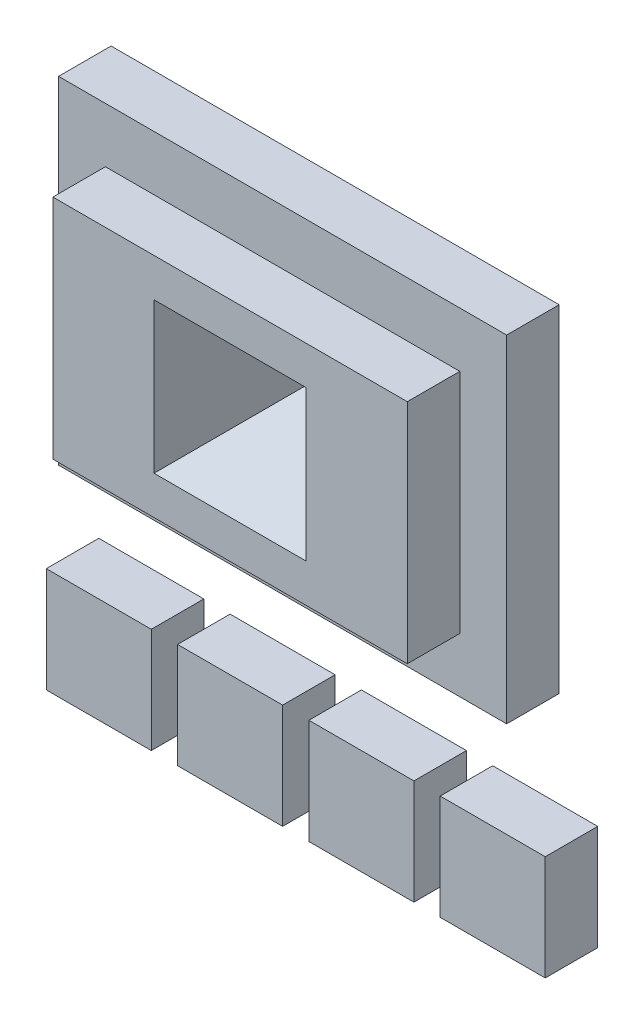
ISO-10303-21;
HEADER;
FILE_DESCRIPTION(('STEP AP214'),'2;1');
FILE_NAME('part.step','',(''),(''),'','','');
FILE_SCHEMA(('AUTOMOTIVE_DESIGN { 1 0 10303 214 1 1 1 1 }'));
ENDSEC;
DATA;
#1=APPLICATION_CONTEXT('core data for automotive mechanical design processes');
#2=APPLICATION_PROTOCOL_DEFINITION('international standard','automotive_design',2000,#1);
#3=PRODUCT_CONTEXT('',#1,'mechanical');
#4=PRODUCT('Part','Part','',(#3));
#5=PRODUCT_RELATED_PRODUCT_CATEGORY('part','',(#4));
#6=PRODUCT_DEFINITION_FORMATION('','',#4);
#7=PRODUCT_DEFINITION_CONTEXT('part definition',#1,'design');
#8=PRODUCT_DEFINITION('design','',#6,#7);
#9=PRODUCT_DEFINITION_SHAPE('','',#8);
#10=(LENGTH_UNIT() NAMED_UNIT(*) SI_UNIT(.MILLI.,.METRE.));
#11=(NAMED_UNIT(*) PLANE_ANGLE_UNIT() SI_UNIT($,.RADIAN.));
#12=(NAMED_UNIT(*) SI_UNIT($,.STERADIAN.) SOLID_ANGLE_UNIT());
#13=UNCERTAINTY_MEASURE_WITH_UNIT(LENGTH_MEASURE(1.E-05),#10,'distance_accuracy_value','');
#14=(GEOMETRIC_REPRESENTATION_CONTEXT(3) GLOBAL_UNCERTAINTY_ASSIGNED_CONTEXT((#13)) GLOBAL_UNIT_ASSIGNED_CONTEXT((#10,
#11,#12)) REPRESENTATION_CONTEXT('',''));
#15=CARTESIAN_POINT('',(0.,0.,0.));
#16=DIRECTION('',(0.,0.,1.));
#17=DIRECTION('',(1.,0.,0.));
#18=AXIS2_PLACEMENT_3D('',#15,#16,#17);
#19=CARTESIAN_POINT('',(77.6562191361146,92.3452044858512,10.));
#20=DIRECTION('',(-1.,0.,0.));
#21=DIRECTION('',(0.,0.,1.));
#22=AXIS2_PLACEMENT_3D('',#19,#20,#21);
#23=PLANE('',#22);
#24=DIRECTION('',(0.,1.,0.));
#25=VECTOR('',#24,1.);
#26=CARTESIAN_POINT('',(77.6562191361146,92.3452044858512,0.));
#27=LINE('',#26,#25);
#28=CARTESIAN_POINT('',(77.6562191361146,28.2315557489202,0.));
#29=VERTEX_POINT('',#28);
#30=CARTESIAN_POINT('',(77.6562191361146,92.3452044858512,0.));
#31=VERTEX_POINT('',#30);
#32=EDGE_CURVE('E231',#29,#31,#27,.T.);
#33=ORIENTED_EDGE('',*,*,#32,.T.);
#34=DIRECTION('',(0.,0.,-1.));
#35=VECTOR('',#34,1.);
#36=CARTESIAN_POINT('',(77.6562191361146,92.3452044858512,10.));
#37=LINE('',#36,#35);
#38=CARTESIAN_POINT('',(77.6562191361146,92.3452044858512,10.));
#39=VERTEX_POINT('',#38);
#40=EDGE_CURVE('E12',#39,#31,#37,.T.);
#41=ORIENTED_EDGE('',*,*,#40,.F.);
#42=DIRECTION('',(0.,1.,0.));
#43=VECTOR('',#42,1.);
#44=CARTESIAN_POINT('',(77.6562191361146,92.3452044858512,10.));
#45=LINE('',#44,#43);
#46=CARTESIAN_POINT('',(77.6562191361146,28.2315557489202,10.));
#47=VERTEX_POINT('',#46);
#48=EDGE_CURVE('E232',#47,#39,#45,.T.);
#49=ORIENTED_EDGE('',*,*,#48,.F.);
#50=DIRECTION('',(0.,0.,-1.));
#51=VECTOR('',#50,1.);
#52=CARTESIAN_POINT('',(77.6562191361146,28.2315557489202,10.));
#53=LINE('',#52,#51);
#54=EDGE_CURVE('E246',#47,#29,#53,.T.);
#55=ORIENTED_EDGE('',*,*,#54,.T.);
#56=EDGE_LOOP('',(#33,#41,#49,#55));
#57=FACE_BOUND('',#56,.T.);
#58=ADVANCED_FACE('F50',(#57),#23,.F.);
#59=CARTESIAN_POINT('',(-7.65621913611464,92.3452044858512,10.));
#60=DIRECTION('',(0.,-1.,0.));
#61=DIRECTION('',(0.,0.,-1.));
#62=AXIS2_PLACEMENT_3D('',#59,#60,#61);
#63=PLANE('',#62);
#64=DIRECTION('',(-1.,0.,0.));
#65=VECTOR('',#64,1.);
#66=CARTESIAN_POINT('',(-7.65621913611464,92.3452044858512,0.));
#67=LINE('',#66,#65);
#68=CARTESIAN_POINT('',(-7.65621913611464,92.3452044858512,0.));
#69=VERTEX_POINT('',#68);
#70=EDGE_CURVE('E250',#31,#69,#67,.T.);
#71=ORIENTED_EDGE('',*,*,#70,.T.);
#72=DIRECTION('',(0.,0.,-1.));
#73=VECTOR('',#72,1.);
#74=CARTESIAN_POINT('',(-7.65621913611464,92.3452044858512,10.));
#75=LINE('',#74,#73);
#76=CARTESIAN_POINT('',(-7.65621913611464,92.3452044858512,10.));
#77=VERTEX_POINT('',#76);
#78=EDGE_CURVE('E58',#77,#69,#75,.T.);
#79=ORIENTED_EDGE('',*,*,#78,.F.);
#80=DIRECTION('',(-1.,0.,0.));
#81=VECTOR('',#80,1.);
#82=CARTESIAN_POINT('',(-7.65621913611464,92.3452044858512,10.));
#83=LINE('',#82,#81);
#84=EDGE_CURVE('E236',#39,#77,#83,.T.);
#85=ORIENTED_EDGE('',*,*,#84,.F.);
#86=ORIENTED_EDGE('',*,*,#40,.T.);
#87=EDGE_LOOP('',(#71,#79,#85,#86));
#88=FACE_BOUND('',#87,.T.);
#89=ADVANCED_FACE('F286',(#88),#63,.F.);
#90=CARTESIAN_POINT('',(-7.65621913611464,92.3452044858512,10.));
#91=DIRECTION('',(1.,0.,0.));
#92=DIRECTION('',(0.,0.,-1.));
#93=AXIS2_PLACEMENT_3D('',#90,#91,#92);
#94=PLANE('',#93);
#95=DIRECTION('',(0.,-1.,0.));
#96=VECTOR('',#95,1.);
#97=CARTESIAN_POINT('',(-7.65621913611464,92.3452044858512,0.));
#98=LINE('',#97,#96);
#99=CARTESIAN_POINT('',(-7.65621913611464,28.2315557489202,0.));
#100=VERTEX_POINT('',#99);
#101=EDGE_CURVE('E253',#69,#100,#98,.T.);
#102=ORIENTED_EDGE('',*,*,#101,.T.);
#103=DIRECTION('',(0.,0.,-1.));
#104=VECTOR('',#103,1.);
#105=CARTESIAN_POINT('',(-7.65621913611464,28.2315557489202,10.));
#106=LINE('',#105,#104);
#107=CARTESIAN_POINT('',(-7.65621913611464,28.2315557489202,10.));
#108=VERTEX_POINT('',#107);
#109=EDGE_CURVE('E261',#108,#100,#106,.T.);
#110=ORIENTED_EDGE('',*,*,#109,.F.);
#111=DIRECTION('',(0.,-1.,0.));
#112=VECTOR('',#111,1.);
#113=CARTESIAN_POINT('',(-7.65621913611464,92.3452044858512,10.));
#114=LINE('',#113,#112);
#115=EDGE_CURVE('E240',#77,#108,#114,.T.);
#116=ORIENTED_EDGE('',*,*,#115,.F.);
#117=ORIENTED_EDGE('',*,*,#78,.T.);
#118=EDGE_LOOP('',(#102,#110,#116,#117));
#119=FACE_BOUND('',#118,.T.);
#120=ADVANCED_FACE('F270',(#119),#94,.F.);
#121=CARTESIAN_POINT('',(-7.65621913611464,28.2315557489202,10.));
#122=DIRECTION('',(0.,1.,0.));
#123=DIRECTION('',(0.,0.,1.));
#124=AXIS2_PLACEMENT_3D('',#121,#122,#123);
#125=PLANE('',#124);
#126=DIRECTION('',(1.,0.,0.));
#127=VECTOR('',#126,1.);
#128=CARTESIAN_POINT('',(-7.65621913611464,28.2315557489202,0.));
#129=LINE('',#128,#127);
#130=EDGE_CURVE('E237',#100,#29,#129,.T.);
#131=ORIENTED_EDGE('',*,*,#130,.T.);
#132=ORIENTED_EDGE('',*,*,#54,.F.);
#133=DIRECTION('',(1.,0.,0.));
#134=VECTOR('',#133,1.);
#135=CARTESIAN_POINT('',(-7.65621913611464,28.2315557489202,10.));
#136=LINE('',#135,#134);
#137=EDGE_CURVE('E243',#108,#47,#136,.T.);
#138=ORIENTED_EDGE('',*,*,#137,.F.);
#139=ORIENTED_EDGE('',*,*,#109,.T.);
#140=EDGE_LOOP('',(#131,#132,#138,#139));
#141=FACE_BOUND('',#140,.T.);
#142=ADVANCED_FACE('F279',(#141),#125,.F.);
#143=CARTESIAN_POINT('',(0.,0.,10.));
#144=DIRECTION('',(0.,0.,1.));
#145=DIRECTION('',(1.,0.,0.));
#146=AXIS2_PLACEMENT_3D('',#143,#144,#145);
#147=PLANE('',#146);
#148=DIRECTION('',(0.,1.,0.));
#149=VECTOR('',#148,1.);
#150=CARTESIAN_POINT('',(68.738200644276,81.8985257449208,10.));
#151=LINE('',#150,#149);
#152=CARTESIAN_POINT('',(68.738200644276,38.6782344898506,10.));
#153=VERTEX_POINT('',#152);
#154=CARTESIAN_POINT('',(68.738200644276,81.8985257449208,10.));
#155=VERTEX_POINT('',#154);
#156=EDGE_CURVE('E170',#153,#155,#151,.T.);
#157=ORIENTED_EDGE('',*,*,#156,.F.);
#158=DIRECTION('',(1.,0.,0.));
#159=VECTOR('',#158,1.);
#160=CARTESIAN_POINT('',(1.26179935572399,38.6782344898506,10.));
#161=LINE('',#160,#159);
#162=CARTESIAN_POINT('',(1.26179935572399,38.6782344898506,10.));
#163=VERTEX_POINT('',#162);
#164=EDGE_CURVE('E192',#163,#153,#161,.T.);
#165=ORIENTED_EDGE('',*,*,#164,.F.);
#166=DIRECTION('',(0.,-1.,0.));
#167=VECTOR('',#166,1.);
#168=CARTESIAN_POINT('',(1.26179935572399,81.8985257449208,10.));
#169=LINE('',#168,#167);
#170=CARTESIAN_POINT('',(1.26179935572399,81.8985257449208,10.));
#171=VERTEX_POINT('',#170);
#172=EDGE_CURVE('E209',#171,#163,#169,.T.);
#173=ORIENTED_EDGE('',*,*,#172,.F.);
#174=DIRECTION('',(-1.,0.,0.));
#175=VECTOR('',#174,1.);
#176=CARTESIAN_POINT('',(1.26179935572399,81.8985257449208,10.));
#177=LINE('',#176,#175);
#178=EDGE_CURVE('E205',#155,#171,#177,.T.);
#179=ORIENTED_EDGE('',*,*,#178,.F.);
#180=EDGE_LOOP('',(#157,#165,#173,#179));
#181=FACE_BOUND('',#180,.T.);
#182=ORIENTED_EDGE('',*,*,#48,.T.);
#183=ORIENTED_EDGE('',*,*,#84,.T.);
#184=ORIENTED_EDGE('',*,*,#115,.T.);
#185=ORIENTED_EDGE('',*,*,#137,.T.);
#186=EDGE_LOOP('',(#182,#183,#184,#185));
#187=FACE_BOUND('',#186,.T.);
#188=ADVANCED_FACE('F285',(#181,#187),#147,.T.);
#189=CARTESIAN_POINT('',(0.,0.,0.));
#190=DIRECTION('',(0.,0.,1.));
#191=DIRECTION('',(1.,0.,0.));
#192=AXIS2_PLACEMENT_3D('',#189,#190,#191);
#193=PLANE('',#192);
#194=DIRECTION('',(1.,0.,0.));
#195=VECTOR('',#194,1.);
#196=CARTESIAN_POINT('',(0.,55.3124303968942,0.));
#197=LINE('',#196,#195);
#198=CARTESIAN_POINT('',(29.840956304275,55.3124303968942,0.));
#199=VERTEX_POINT('',#198);
#200=CARTESIAN_POINT('',(40.159043695725,55.3124303968942,0.));
#201=VERTEX_POINT('',#200);
#202=EDGE_CURVE('E172',#199,#201,#197,.T.);
#203=ORIENTED_EDGE('',*,*,#202,.T.);
#204=DIRECTION('',(0.,1.,0.));
#205=VECTOR('',#204,1.);
#206=CARTESIAN_POINT('',(40.159043695725,0.,0.));
#207=LINE('',#206,#205);
#208=CARTESIAN_POINT('',(40.159043695725,65.2643298378772,0.));
#209=VERTEX_POINT('',#208);
#210=EDGE_CURVE('E163',#201,#209,#207,.T.);
#211=ORIENTED_EDGE('',*,*,#210,.T.);
#212=DIRECTION('',(-1.,0.,0.));
#213=VECTOR('',#212,1.);
#214=CARTESIAN_POINT('',(0.,65.2643298378772,0.));
#215=LINE('',#214,#213);
#216=CARTESIAN_POINT('',(29.840956304275,65.2643298378772,0.));
#217=VERTEX_POINT('',#216);
#218=EDGE_CURVE('E179',#209,#217,#215,.T.);
#219=ORIENTED_EDGE('',*,*,#218,.T.);
#220=DIRECTION('',(0.,-1.,0.));
#221=VECTOR('',#220,1.);
#222=CARTESIAN_POINT('',(29.840956304275,0.,0.));
#223=LINE('',#222,#221);
#224=EDGE_CURVE('E65',#217,#199,#223,.T.);
#225=ORIENTED_EDGE('',*,*,#224,.T.);
#226=EDGE_LOOP('',(#203,#211,#219,#225));
#227=FACE_BOUND('',#226,.T.);
#228=ORIENTED_EDGE('',*,*,#32,.F.);
#229=ORIENTED_EDGE('',*,*,#130,.F.);
#230=ORIENTED_EDGE('',*,*,#101,.F.);
#231=ORIENTED_EDGE('',*,*,#70,.F.);
#232=EDGE_LOOP('',(#228,#229,#230,#231));
#233=FACE_BOUND('',#232,.T.);
#234=ADVANCED_FACE('F276',(#227,#233),#193,.F.);
#235=CARTESIAN_POINT('',(68.738200644276,81.8985257449208,20.));
#236=DIRECTION('',(-1.,0.,0.));
#237=DIRECTION('',(0.,0.,1.));
#238=AXIS2_PLACEMENT_3D('',#235,#236,#237);
#239=PLANE('',#238);
#240=ORIENTED_EDGE('',*,*,#156,.T.);
#241=DIRECTION('',(0.,0.,-1.));
#242=VECTOR('',#241,1.);
#243=CARTESIAN_POINT('',(68.738200644276,81.8985257449208,20.));
#244=LINE('',#243,#242);
#245=CARTESIAN_POINT('',(68.738200644276,81.8985257449208,20.));
#246=VERTEX_POINT('',#245);
#247=EDGE_CURVE('E227',#246,#155,#244,.T.);
#248=ORIENTED_EDGE('',*,*,#247,.F.);
#249=DIRECTION('',(0.,1.,0.));
#250=VECTOR('',#249,1.);
#251=CARTESIAN_POINT('',(68.738200644276,81.8985257449208,20.));
#252=LINE('',#251,#250);
#253=CARTESIAN_POINT('',(68.738200644276,38.6782344898506,20.));
#254=VERTEX_POINT('',#253);
#255=EDGE_CURVE('E187',#254,#246,#252,.T.);
#256=ORIENTED_EDGE('',*,*,#255,.F.);
#257=DIRECTION('',(0.,0.,-1.));
#258=VECTOR('',#257,1.);
#259=CARTESIAN_POINT('',(68.738200644276,38.6782344898506,20.));
#260=LINE('',#259,#258);
#261=EDGE_CURVE('E201',#254,#153,#260,.T.);
#262=ORIENTED_EDGE('',*,*,#261,.T.);
#263=EDGE_LOOP('',(#240,#248,#256,#262));
#264=FACE_BOUND('',#263,.T.);
#265=ADVANCED_FACE('F298',(#264),#239,.F.);
#266=CARTESIAN_POINT('',(1.26179935572399,81.8985257449208,20.));
#267=DIRECTION('',(0.,-1.,0.));
#268=DIRECTION('',(0.,0.,-1.));
#269=AXIS2_PLACEMENT_3D('',#266,#267,#268);
#270=PLANE('',#269);
#271=ORIENTED_EDGE('',*,*,#178,.T.);
#272=DIRECTION('',(0.,0.,-1.));
#273=VECTOR('',#272,1.);
#274=CARTESIAN_POINT('',(1.26179935572399,81.8985257449208,20.));
#275=LINE('',#274,#273);
#276=CARTESIAN_POINT('',(1.26179935572399,81.8985257449208,20.));
#277=VERTEX_POINT('',#276);
#278=EDGE_CURVE('E223',#277,#171,#275,.T.);
#279=ORIENTED_EDGE('',*,*,#278,.F.);
#280=DIRECTION('',(-1.,0.,0.));
#281=VECTOR('',#280,1.);
#282=CARTESIAN_POINT('',(1.26179935572399,81.8985257449208,20.));
#283=LINE('',#282,#281);
#284=EDGE_CURVE('E191',#246,#277,#283,.T.);
#285=ORIENTED_EDGE('',*,*,#284,.F.);
#286=ORIENTED_EDGE('',*,*,#247,.T.);
#287=EDGE_LOOP('',(#271,#279,#285,#286));
#288=FACE_BOUND('',#287,.T.);
#289=ADVANCED_FACE('F305',(#288),#270,.F.);
#290=CARTESIAN_POINT('',(1.26179935572399,81.8985257449208,20.));
#291=DIRECTION('',(1.,0.,0.));
#292=DIRECTION('',(0.,0.,-1.));
#293=AXIS2_PLACEMENT_3D('',#290,#291,#292);
#294=PLANE('',#293);
#295=ORIENTED_EDGE('',*,*,#172,.T.);
#296=DIRECTION('',(0.,0.,-1.));
#297=VECTOR('',#296,1.);
#298=CARTESIAN_POINT('',(1.26179935572399,38.6782344898506,20.));
#299=LINE('',#298,#297);
#300=CARTESIAN_POINT('',(1.26179935572399,38.6782344898506,20.));
#301=VERTEX_POINT('',#300);
#302=EDGE_CURVE('E219',#301,#163,#299,.T.);
#303=ORIENTED_EDGE('',*,*,#302,.F.);
#304=DIRECTION('',(0.,-1.,0.));
#305=VECTOR('',#304,1.);
#306=CARTESIAN_POINT('',(1.26179935572399,81.8985257449208,20.));
#307=LINE('',#306,#305);
#308=EDGE_CURVE('E195',#277,#301,#307,.T.);
#309=ORIENTED_EDGE('',*,*,#308,.F.);
#310=ORIENTED_EDGE('',*,*,#278,.T.);
#311=EDGE_LOOP('',(#295,#303,#309,#310));
#312=FACE_BOUND('',#311,.T.);
#313=ADVANCED_FACE('F309',(#312),#294,.F.);
#314=CARTESIAN_POINT('',(1.26179935572399,38.6782344898506,20.));
#315=DIRECTION('',(0.,1.,0.));
#316=DIRECTION('',(0.,0.,1.));
#317=AXIS2_PLACEMENT_3D('',#314,#315,#316);
#318=PLANE('',#317);
#319=ORIENTED_EDGE('',*,*,#164,.T.);
#320=ORIENTED_EDGE('',*,*,#261,.F.);
#321=DIRECTION('',(1.,0.,0.));
#322=VECTOR('',#321,1.);
#323=CARTESIAN_POINT('',(1.26179935572399,38.6782344898506,20.));
#324=LINE('',#323,#322);
#325=EDGE_CURVE('E198',#301,#254,#324,.T.);
#326=ORIENTED_EDGE('',*,*,#325,.F.);
#327=ORIENTED_EDGE('',*,*,#302,.T.);
#328=EDGE_LOOP('',(#319,#320,#326,#327));
#329=FACE_BOUND('',#328,.T.);
#330=ADVANCED_FACE('F313',(#329),#318,.F.);
#331=CARTESIAN_POINT('',(0.,0.,20.));
#332=DIRECTION('',(0.,0.,1.));
#333=DIRECTION('',(1.,0.,0.));
#334=AXIS2_PLACEMENT_3D('',#331,#332,#333);
#335=PLANE('',#334);
#336=DIRECTION('',(0.,1.,0.));
#337=VECTOR('',#336,1.);
#338=CARTESIAN_POINT('',(49.485196858825,74.5904830009772,20.));
#339=LINE('',#338,#337);
#340=CARTESIAN_POINT('',(49.485196858825,45.9862772337942,20.));
#341=VERTEX_POINT('',#340);
#342=CARTESIAN_POINT('',(49.485196858825,74.5904830009772,20.));
#343=VERTEX_POINT('',#342);
#344=EDGE_CURVE('E73',#341,#343,#339,.T.);
#345=ORIENTED_EDGE('',*,*,#344,.F.);
#346=DIRECTION('',(1.,0.,0.));
#347=VECTOR('',#346,1.);
#348=CARTESIAN_POINT('',(20.514803141175,45.9862772337942,20.));
#349=LINE('',#348,#347);
#350=CARTESIAN_POINT('',(20.514803141175,45.9862772337942,20.));
#351=VERTEX_POINT('',#350);
#352=EDGE_CURVE('E159',#351,#341,#349,.T.);
#353=ORIENTED_EDGE('',*,*,#352,.F.);
#354=DIRECTION('',(0.,-1.,0.));
#355=VECTOR('',#354,1.);
#356=CARTESIAN_POINT('',(20.514803141175,74.5904830009772,20.));
#357=LINE('',#356,#355);
#358=CARTESIAN_POINT('',(20.514803141175,74.5904830009772,20.));
#359=VERTEX_POINT('',#358);
#360=EDGE_CURVE('E141',#359,#351,#357,.T.);
#361=ORIENTED_EDGE('',*,*,#360,.F.);
#362=DIRECTION('',(-1.,0.,0.));
#363=VECTOR('',#362,1.);
#364=CARTESIAN_POINT('',(20.514803141175,74.5904830009772,20.));
#365=LINE('',#364,#363);
#366=EDGE_CURVE('E151',#343,#359,#365,.T.);
#367=ORIENTED_EDGE('',*,*,#366,.F.);
#368=EDGE_LOOP('',(#345,#353,#361,#367));
#369=FACE_BOUND('',#368,.T.);
#370=ORIENTED_EDGE('',*,*,#255,.T.);
#371=ORIENTED_EDGE('',*,*,#284,.T.);
#372=ORIENTED_EDGE('',*,*,#308,.T.);
#373=ORIENTED_EDGE('',*,*,#325,.T.);
#374=EDGE_LOOP('',(#370,#371,#372,#373));
#375=FACE_BOUND('',#374,.T.);
#376=ADVANCED_FACE('F156',(#369,#375),#335,.T.);
#377=CARTESIAN_POINT('',(49.485196858825,74.5904830009772,20.));
#378=DIRECTION('',(0.90630778703665,0.,-0.4226182617407));
#379=DIRECTION('',(-0.4226182617407,0.,-0.90630778703665));
#380=AXIS2_PLACEMENT_3D('',#377,#378,#379);
#381=PLANE('',#380);
#382=ORIENTED_EDGE('',*,*,#344,.T.);
#383=DIRECTION('',(0.389281620635025,0.389281620635025,0.834817129478988));
#384=VECTOR('',#383,1.);
#385=CARTESIAN_POINT('',(49.485196858825,74.5904830009772,20.));
#386=LINE('',#385,#384);
#387=EDGE_CURVE('E148',#209,#343,#386,.T.);
#388=ORIENTED_EDGE('',*,*,#387,.F.);
#389=ORIENTED_EDGE('',*,*,#210,.F.);
#390=DIRECTION('',(0.389281620635025,-0.389281620635025,0.834817129478988));
#391=VECTOR('',#390,1.);
#392=CARTESIAN_POINT('',(45.0950181754236,50.3764559171956,10.5852314311721));
#393=LINE('',#392,#391);
#394=EDGE_CURVE('E167',#201,#341,#393,.T.);
#395=ORIENTED_EDGE('',*,*,#394,.T.);
#396=EDGE_LOOP('',(#382,#388,#389,#395));
#397=FACE_BOUND('',#396,.T.);
#398=ADVANCED_FACE('F320',(#397),#381,.F.);
#399=CARTESIAN_POINT('',(20.514803141175,45.9862772337942,20.));
#400=DIRECTION('',(0.,-0.90630778703665,-0.4226182617407));
#401=DIRECTION('',(0.,0.4226182617407,-0.90630778703665));
#402=AXIS2_PLACEMENT_3D('',#399,#400,#401);
#403=PLANE('',#402);
#404=ORIENTED_EDGE('',*,*,#352,.T.);
#405=ORIENTED_EDGE('',*,*,#394,.F.);
#406=ORIENTED_EDGE('',*,*,#202,.F.);
#407=DIRECTION('',(-0.389281620635025,-0.389281620635025,0.834817129478988));
#408=VECTOR('',#407,1.);
#409=CARTESIAN_POINT('',(24.8494896365887,50.3209637292079,10.7042348123461));
#410=LINE('',#409,#408);
#411=EDGE_CURVE('E147',#199,#351,#410,.T.);
#412=ORIENTED_EDGE('',*,*,#411,.T.);
#413=EDGE_LOOP('',(#404,#405,#406,#412));
#414=FACE_BOUND('',#413,.T.);
#415=ADVANCED_FACE('F321',(#414),#403,.F.);
#416=CARTESIAN_POINT('',(20.514803141175,74.5904830009772,20.));
#417=DIRECTION('',(-0.90630778703665,0.,-0.4226182617407));
#418=DIRECTION('',(-0.4226182617407,0.,0.90630778703665));
#419=AXIS2_PLACEMENT_3D('',#416,#417,#418);
#420=PLANE('',#419);
#421=ORIENTED_EDGE('',*,*,#360,.T.);
#422=ORIENTED_EDGE('',*,*,#411,.F.);
#423=ORIENTED_EDGE('',*,*,#224,.F.);
#424=DIRECTION('',(-0.389281620635025,0.389281620635025,0.834817129478988));
#425=VECTOR('',#424,1.);
#426=CARTESIAN_POINT('',(20.514803141175,74.5904830009772,20.));
#427=LINE('',#426,#425);
#428=EDGE_CURVE('E137',#217,#359,#427,.T.);
#429=ORIENTED_EDGE('',*,*,#428,.T.);
#430=EDGE_LOOP('',(#421,#422,#423,#429));
#431=FACE_BOUND('',#430,.T.);
#432=ADVANCED_FACE('F139',(#431),#420,.F.);
#433=CARTESIAN_POINT('',(20.514803141175,74.5904830009772,20.));
#434=DIRECTION('',(0.,0.90630778703665,-0.4226182617407));
#435=DIRECTION('',(0.,0.4226182617407,0.90630778703665));
#436=AXIS2_PLACEMENT_3D('',#433,#434,#435);
#437=PLANE('',#436);
#438=ORIENTED_EDGE('',*,*,#366,.T.);
#439=ORIENTED_EDGE('',*,*,#428,.F.);
#440=ORIENTED_EDGE('',*,*,#218,.F.);
#441=ORIENTED_EDGE('',*,*,#387,.T.);
#442=EDGE_LOOP('',(#438,#439,#440,#441));
#443=FACE_BOUND('',#442,.T.);
#444=ADVANCED_FACE('F152',(#443),#437,.F.);
#445=CLOSED_SHELL('',(#58,#89,#120,#142,#188,#234,#265,#289,#313,#330,#376,#398,#415,#432,#444));
#446=MANIFOLD_SOLID_BREP('B2',#445);
#447=CARTESIAN_POINT('',(85.,10.,10.));
#448=DIRECTION('',(-1.,0.,0.));
#449=DIRECTION('',(0.,0.,1.));
#450=AXIS2_PLACEMENT_3D('',#447,#448,#449);
#451=PLANE('',#450);
#452=DIRECTION('',(0.,1.,0.));
#453=VECTOR('',#452,1.);
#454=CARTESIAN_POINT('',(85.,10.,0.));
#455=LINE('',#454,#453);
#456=CARTESIAN_POINT('',(85.,-10.,0.));
#457=VERTEX_POINT('',#456);
#458=CARTESIAN_POINT('',(85.,10.,0.));
#459=VERTEX_POINT('',#458);
#460=EDGE_CURVE('E504',#457,#459,#455,.T.);
#461=ORIENTED_EDGE('',*,*,#460,.T.);
#462=DIRECTION('',(0.,0.,-1.));
#463=VECTOR('',#462,1.);
#464=CARTESIAN_POINT('',(85.,10.,10.));
#465=LINE('',#464,#463);
#466=CARTESIAN_POINT('',(85.,10.,10.));
#467=VERTEX_POINT('',#466);
#468=EDGE_CURVE('E48',#467,#459,#465,.T.);
#469=ORIENTED_EDGE('',*,*,#468,.F.);
#470=DIRECTION('',(0.,1.,0.));
#471=VECTOR('',#470,1.);
#472=CARTESIAN_POINT('',(85.,10.,10.));
#473=LINE('',#472,#471);
#474=CARTESIAN_POINT('',(85.,-10.,10.));
#475=VERTEX_POINT('',#474);
#476=EDGE_CURVE('E492',#475,#467,#473,.T.);
#477=ORIENTED_EDGE('',*,*,#476,.F.);
#478=DIRECTION('',(0.,0.,-1.));
#479=VECTOR('',#478,1.);
#480=CARTESIAN_POINT('',(85.,-10.,10.));
#481=LINE('',#480,#479);
#482=EDGE_CURVE('E500',#475,#457,#481,.T.);
#483=ORIENTED_EDGE('',*,*,#482,.T.);
#484=EDGE_LOOP('',(#461,#469,#477,#483));
#485=FACE_BOUND('',#484,.T.);
#486=ADVANCED_FACE('F441',(#485),#451,.F.);
#487=CARTESIAN_POINT('',(65.,10.,10.));
#488=DIRECTION('',(0.,-1.,0.));
#489=DIRECTION('',(0.,0.,-1.));
#490=AXIS2_PLACEMENT_3D('',#487,#488,#489);
#491=PLANE('',#490);
#492=DIRECTION('',(-1.,0.,0.));
#493=VECTOR('',#492,1.);
#494=CARTESIAN_POINT('',(65.,10.,0.));
#495=LINE('',#494,#493);
#496=CARTESIAN_POINT('',(65.,10.,0.));
#497=VERTEX_POINT('',#496);
#498=EDGE_CURVE('E496',#459,#497,#495,.T.);
#499=ORIENTED_EDGE('',*,*,#498,.T.);
#500=DIRECTION('',(0.,0.,-1.));
#501=VECTOR('',#500,1.);
#502=CARTESIAN_POINT('',(65.,10.,10.));
#503=LINE('',#502,#501);
#504=CARTESIAN_POINT('',(65.,10.,10.));
#505=VERTEX_POINT('',#504);
#506=EDGE_CURVE('E449',#505,#497,#503,.T.);
#507=ORIENTED_EDGE('',*,*,#506,.F.);
#508=DIRECTION('',(-1.,0.,0.));
#509=VECTOR('',#508,1.);
#510=CARTESIAN_POINT('',(65.,10.,10.));
#511=LINE('',#510,#509);
#512=EDGE_CURVE('E487',#467,#505,#511,.T.);
#513=ORIENTED_EDGE('',*,*,#512,.F.);
#514=ORIENTED_EDGE('',*,*,#468,.T.);
#515=EDGE_LOOP('',(#499,#507,#513,#514));
#516=FACE_BOUND('',#515,.T.);
#517=ADVANCED_FACE('F495',(#516),#491,.F.);
#518=CARTESIAN_POINT('',(65.,10.,10.));
#519=DIRECTION('',(1.,0.,0.));
#520=DIRECTION('',(0.,0.,-1.));
#521=AXIS2_PLACEMENT_3D('',#518,#519,#520);
#522=PLANE('',#521);
#523=DIRECTION('',(0.,-1.,0.));
#524=VECTOR('',#523,1.);
#525=CARTESIAN_POINT('',(65.,10.,0.));
#526=LINE('',#525,#524);
#527=CARTESIAN_POINT('',(65.,-10.,0.));
#528=VERTEX_POINT('',#527);
#529=EDGE_CURVE('E474',#497,#528,#526,.T.);
#530=ORIENTED_EDGE('',*,*,#529,.T.);
#531=DIRECTION('',(0.,0.,-1.));
#532=VECTOR('',#531,1.);
#533=CARTESIAN_POINT('',(65.,-10.,10.));
#534=LINE('',#533,#532);
#535=CARTESIAN_POINT('',(65.,-10.,10.));
#536=VERTEX_POINT('',#535);
#537=EDGE_CURVE('E497',#536,#528,#534,.T.);
#538=ORIENTED_EDGE('',*,*,#537,.F.);
#539=DIRECTION('',(0.,-1.,0.));
#540=VECTOR('',#539,1.);
#541=CARTESIAN_POINT('',(65.,10.,10.));
#542=LINE('',#541,#540);
#543=EDGE_CURVE('E490',#505,#536,#542,.T.);
#544=ORIENTED_EDGE('',*,*,#543,.F.);
#545=ORIENTED_EDGE('',*,*,#506,.T.);
#546=EDGE_LOOP('',(#530,#538,#544,#545));
#547=FACE_BOUND('',#546,.T.);
#548=ADVANCED_FACE('F498',(#547),#522,.F.);
#549=CARTESIAN_POINT('',(65.,-10.,10.));
#550=DIRECTION('',(0.,1.,0.));
#551=DIRECTION('',(0.,0.,1.));
#552=AXIS2_PLACEMENT_3D('',#549,#550,#551);
#553=PLANE('',#552);
#554=DIRECTION('',(1.,0.,0.));
#555=VECTOR('',#554,1.);
#556=CARTESIAN_POINT('',(65.,-10.,0.));
#557=LINE('',#556,#555);
#558=EDGE_CURVE('E480',#528,#457,#557,.T.);
#559=ORIENTED_EDGE('',*,*,#558,.T.);
#560=ORIENTED_EDGE('',*,*,#482,.F.);
#561=DIRECTION('',(1.,0.,0.));
#562=VECTOR('',#561,1.);
#563=CARTESIAN_POINT('',(65.,-10.,10.));
#564=LINE('',#563,#562);
#565=EDGE_CURVE('E457',#536,#475,#564,.T.);
#566=ORIENTED_EDGE('',*,*,#565,.F.);
#567=ORIENTED_EDGE('',*,*,#537,.T.);
#568=EDGE_LOOP('',(#559,#560,#566,#567));
#569=FACE_BOUND('',#568,.T.);
#570=ADVANCED_FACE('F511',(#569),#553,.F.);
#571=CARTESIAN_POINT('',(0.,0.,10.));
#572=DIRECTION('',(0.,0.,1.));
#573=DIRECTION('',(1.,0.,0.));
#574=AXIS2_PLACEMENT_3D('',#571,#572,#573);
#575=PLANE('',#574);
#576=ORIENTED_EDGE('',*,*,#476,.T.);
#577=ORIENTED_EDGE('',*,*,#512,.T.);
#578=ORIENTED_EDGE('',*,*,#543,.T.);
#579=ORIENTED_EDGE('',*,*,#565,.T.);
#580=EDGE_LOOP('',(#576,#577,#578,#579));
#581=FACE_BOUND('',#580,.T.);
#582=ADVANCED_FACE('F488',(#581),#575,.T.);
#583=CARTESIAN_POINT('',(0.,0.,0.));
#584=DIRECTION('',(0.,0.,1.));
#585=DIRECTION('',(1.,0.,0.));
#586=AXIS2_PLACEMENT_3D('',#583,#584,#585);
#587=PLANE('',#586);
#588=ORIENTED_EDGE('',*,*,#460,.F.);
#589=ORIENTED_EDGE('',*,*,#558,.F.);
#590=ORIENTED_EDGE('',*,*,#529,.F.);
#591=ORIENTED_EDGE('',*,*,#498,.F.);
#592=EDGE_LOOP('',(#588,#589,#590,#591));
#593=FACE_BOUND('',#592,.T.);
#594=ADVANCED_FACE('F514',(#593),#587,.F.);
#595=CLOSED_SHELL('',(#486,#517,#548,#570,#582,#594));
#596=MANIFOLD_SOLID_BREP('B6',#595);
#597=CARTESIAN_POINT('',(60.,10.,10.));
#598=DIRECTION('',(-1.,0.,0.));
#599=DIRECTION('',(0.,-1.,0.));
#600=AXIS2_PLACEMENT_3D('',#597,#598,#599);
#601=PLANE('',#600);
#602=DIRECTION('',(0.,1.,0.));
#603=VECTOR('',#602,1.);
#604=CARTESIAN_POINT('',(60.,10.,0.));
#605=LINE('',#604,#603);
#606=CARTESIAN_POINT('',(60.,-10.,0.));
#607=VERTEX_POINT('',#606);
#608=CARTESIAN_POINT('',(60.,10.,0.));
#609=VERTEX_POINT('',#608);
#610=EDGE_CURVE('E638',#607,#609,#605,.T.);
#611=ORIENTED_EDGE('',*,*,#610,.T.);
#612=DIRECTION('',(0.,0.,-1.));
#613=VECTOR('',#612,1.);
#614=CARTESIAN_POINT('',(60.,10.,10.));
#615=LINE('',#614,#613);
#616=CARTESIAN_POINT('',(60.,10.,10.));
#617=VERTEX_POINT('',#616);
#618=EDGE_CURVE('E439',#617,#609,#615,.T.);
#619=ORIENTED_EDGE('',*,*,#618,.F.);
#620=DIRECTION('',(0.,1.,0.));
#621=VECTOR('',#620,1.);
#622=CARTESIAN_POINT('',(60.,10.,10.));
#623=LINE('',#622,#621);
#624=CARTESIAN_POINT('',(60.,-10.,10.));
#625=VERTEX_POINT('',#624);
#626=EDGE_CURVE('E626',#625,#617,#623,.T.);
#627=ORIENTED_EDGE('',*,*,#626,.F.);
#628=DIRECTION('',(0.,0.,-1.));
#629=VECTOR('',#628,1.);
#630=CARTESIAN_POINT('',(60.,-10.,10.));
#631=LINE('',#630,#629);
#632=EDGE_CURVE('E634',#625,#607,#631,.T.);
#633=ORIENTED_EDGE('',*,*,#632,.T.);
#634=EDGE_LOOP('',(#611,#619,#627,#633));
#635=FACE_BOUND('',#634,.T.);
#636=ADVANCED_FACE('F575',(#635),#601,.F.);
#637=CARTESIAN_POINT('',(40.,10.,10.));
#638=DIRECTION('',(0.,-1.,0.));
#639=DIRECTION('',(0.,0.,-1.));
#640=AXIS2_PLACEMENT_3D('',#637,#638,#639);
#641=PLANE('',#640);
#642=DIRECTION('',(-1.,0.,0.));
#643=VECTOR('',#642,1.);
#644=CARTESIAN_POINT('',(40.,10.,0.));
#645=LINE('',#644,#643);
#646=CARTESIAN_POINT('',(40.,10.,0.));
#647=VERTEX_POINT('',#646);
#648=EDGE_CURVE('E630',#609,#647,#645,.T.);
#649=ORIENTED_EDGE('',*,*,#648,.T.);
#650=DIRECTION('',(0.,0.,-1.));
#651=VECTOR('',#650,1.);
#652=CARTESIAN_POINT('',(40.,10.,10.));
#653=LINE('',#652,#651);
#654=CARTESIAN_POINT('',(40.,10.,10.));
#655=VERTEX_POINT('',#654);
#656=EDGE_CURVE('E583',#655,#647,#653,.T.);
#657=ORIENTED_EDGE('',*,*,#656,.F.);
#658=DIRECTION('',(-1.,0.,0.));
#659=VECTOR('',#658,1.);
#660=CARTESIAN_POINT('',(40.,10.,10.));
#661=LINE('',#660,#659);
#662=EDGE_CURVE('E621',#617,#655,#661,.T.);
#663=ORIENTED_EDGE('',*,*,#662,.F.);
#664=ORIENTED_EDGE('',*,*,#618,.T.);
#665=EDGE_LOOP('',(#649,#657,#663,#664));
#666=FACE_BOUND('',#665,.T.);
#667=ADVANCED_FACE('F629',(#666),#641,.F.);
#668=CARTESIAN_POINT('',(40.,10.,10.));
#669=DIRECTION('',(1.,0.,0.));
#670=DIRECTION('',(0.,0.,-1.));
#671=AXIS2_PLACEMENT_3D('',#668,#669,#670);
#672=PLANE('',#671);
#673=DIRECTION('',(0.,-1.,0.));
#674=VECTOR('',#673,1.);
#675=CARTESIAN_POINT('',(40.,10.,0.));
#676=LINE('',#675,#674);
#677=CARTESIAN_POINT('',(40.,-10.,0.));
#678=VERTEX_POINT('',#677);
#679=EDGE_CURVE('E608',#647,#678,#676,.T.);
#680=ORIENTED_EDGE('',*,*,#679,.T.);
#681=DIRECTION('',(0.,0.,-1.));
#682=VECTOR('',#681,1.);
#683=CARTESIAN_POINT('',(40.,-10.,10.));
#684=LINE('',#683,#682);
#685=CARTESIAN_POINT('',(40.,-10.,10.));
#686=VERTEX_POINT('',#685);
#687=EDGE_CURVE('E631',#686,#678,#684,.T.);
#688=ORIENTED_EDGE('',*,*,#687,.F.);
#689=DIRECTION('',(0.,-1.,0.));
#690=VECTOR('',#689,1.);
#691=CARTESIAN_POINT('',(40.,10.,10.));
#692=LINE('',#691,#690);
#693=EDGE_CURVE('E624',#655,#686,#692,.T.);
#694=ORIENTED_EDGE('',*,*,#693,.F.);
#695=ORIENTED_EDGE('',*,*,#656,.T.);
#696=EDGE_LOOP('',(#680,#688,#694,#695));
#697=FACE_BOUND('',#696,.T.);
#698=ADVANCED_FACE('F632',(#697),#672,.F.);
#699=CARTESIAN_POINT('',(40.,-10.,10.));
#700=DIRECTION('',(0.,1.,0.));
#701=DIRECTION('',(0.,0.,1.));
#702=AXIS2_PLACEMENT_3D('',#699,#700,#701);
#703=PLANE('',#702);
#704=DIRECTION('',(1.,0.,0.));
#705=VECTOR('',#704,1.);
#706=CARTESIAN_POINT('',(40.,-10.,0.));
#707=LINE('',#706,#705);
#708=EDGE_CURVE('E614',#678,#607,#707,.T.);
#709=ORIENTED_EDGE('',*,*,#708,.T.);
#710=ORIENTED_EDGE('',*,*,#632,.F.);
#711=DIRECTION('',(1.,0.,0.));
#712=VECTOR('',#711,1.);
#713=CARTESIAN_POINT('',(40.,-10.,10.));
#714=LINE('',#713,#712);
#715=EDGE_CURVE('E591',#686,#625,#714,.T.);
#716=ORIENTED_EDGE('',*,*,#715,.F.);
#717=ORIENTED_EDGE('',*,*,#687,.T.);
#718=EDGE_LOOP('',(#709,#710,#716,#717));
#719=FACE_BOUND('',#718,.T.);
#720=ADVANCED_FACE('F645',(#719),#703,.F.);
#721=CARTESIAN_POINT('',(0.,0.,10.));
#722=DIRECTION('',(0.,0.,1.));
#723=DIRECTION('',(1.,0.,0.));
#724=AXIS2_PLACEMENT_3D('',#721,#722,#723);
#725=PLANE('',#724);
#726=ORIENTED_EDGE('',*,*,#626,.T.);
#727=ORIENTED_EDGE('',*,*,#662,.T.);
#728=ORIENTED_EDGE('',*,*,#693,.T.);
#729=ORIENTED_EDGE('',*,*,#715,.T.);
#730=EDGE_LOOP('',(#726,#727,#728,#729));
#731=FACE_BOUND('',#730,.T.);
#732=ADVANCED_FACE('F622',(#731),#725,.T.);
#733=CARTESIAN_POINT('',(0.,0.,0.));
#734=DIRECTION('',(0.,0.,1.));
#735=DIRECTION('',(1.,0.,0.));
#736=AXIS2_PLACEMENT_3D('',#733,#734,#735);
#737=PLANE('',#736);
#738=ORIENTED_EDGE('',*,*,#610,.F.);
#739=ORIENTED_EDGE('',*,*,#708,.F.);
#740=ORIENTED_EDGE('',*,*,#679,.F.);
#741=ORIENTED_EDGE('',*,*,#648,.F.);
#742=EDGE_LOOP('',(#738,#739,#740,#741));
#743=FACE_BOUND('',#742,.T.);
#744=ADVANCED_FACE('F648',(#743),#737,.F.);
#745=CLOSED_SHELL('',(#636,#667,#698,#720,#732,#744));
#746=MANIFOLD_SOLID_BREP('B42',#745);
#747=CARTESIAN_POINT('',(35.,10.,10.));
#748=DIRECTION('',(-1.,0.,0.));
#749=DIRECTION('',(0.,0.,1.));
#750=AXIS2_PLACEMENT_3D('',#747,#748,#749);
#751=PLANE('',#750);
#752=DIRECTION('',(0.,1.,0.));
#753=VECTOR('',#752,1.);
#754=CARTESIAN_POINT('',(35.,10.,0.));
#755=LINE('',#754,#753);
#756=CARTESIAN_POINT('',(35.,-10.,0.));
#757=VERTEX_POINT('',#756);
#758=CARTESIAN_POINT('',(35.,10.,0.));
#759=VERTEX_POINT('',#758);
#760=EDGE_CURVE('E771',#757,#759,#755,.T.);
#761=ORIENTED_EDGE('',*,*,#760,.T.);
#762=DIRECTION('',(0.,0.,-1.));
#763=VECTOR('',#762,1.);
#764=CARTESIAN_POINT('',(35.,10.,10.));
#765=LINE('',#764,#763);
#766=CARTESIAN_POINT('',(35.,10.,10.));
#767=VERTEX_POINT('',#766);
#768=EDGE_CURVE('E573',#767,#759,#765,.T.);
#769=ORIENTED_EDGE('',*,*,#768,.F.);
#770=DIRECTION('',(0.,1.,0.));
#771=VECTOR('',#770,1.);
#772=CARTESIAN_POINT('',(35.,10.,10.));
#773=LINE('',#772,#771);
#774=CARTESIAN_POINT('',(35.,-10.,10.));
#775=VERTEX_POINT('',#774);
#776=EDGE_CURVE('E759',#775,#767,#773,.T.);
#777=ORIENTED_EDGE('',*,*,#776,.F.);
#778=DIRECTION('',(0.,0.,-1.));
#779=VECTOR('',#778,1.);
#780=CARTESIAN_POINT('',(35.,-10.,10.));
#781=LINE('',#780,#779);
#782=EDGE_CURVE('E767',#775,#757,#781,.T.);
#783=ORIENTED_EDGE('',*,*,#782,.T.);
#784=EDGE_LOOP('',(#761,#769,#777,#783));
#785=FACE_BOUND('',#784,.T.);
#786=ADVANCED_FACE('F708',(#785),#751,.F.);
#787=CARTESIAN_POINT('',(15.,10.,10.));
#788=DIRECTION('',(0.,-1.,0.));
#789=DIRECTION('',(0.,0.,-1.));
#790=AXIS2_PLACEMENT_3D('',#787,#788,#789);
#791=PLANE('',#790);
#792=DIRECTION('',(-1.,0.,0.));
#793=VECTOR('',#792,1.);
#794=CARTESIAN_POINT('',(15.,10.,0.));
#795=LINE('',#794,#793);
#796=CARTESIAN_POINT('',(15.,10.,0.));
#797=VERTEX_POINT('',#796);
#798=EDGE_CURVE('E763',#759,#797,#795,.T.);
#799=ORIENTED_EDGE('',*,*,#798,.T.);
#800=DIRECTION('',(0.,0.,-1.));
#801=VECTOR('',#800,1.);
#802=CARTESIAN_POINT('',(15.,10.,10.));
#803=LINE('',#802,#801);
#804=CARTESIAN_POINT('',(15.,10.,10.));
#805=VERTEX_POINT('',#804);
#806=EDGE_CURVE('E716',#805,#797,#803,.T.);
#807=ORIENTED_EDGE('',*,*,#806,.F.);
#808=DIRECTION('',(-1.,0.,0.));
#809=VECTOR('',#808,1.);
#810=CARTESIAN_POINT('',(15.,10.,10.));
#811=LINE('',#810,#809);
#812=EDGE_CURVE('E754',#767,#805,#811,.T.);
#813=ORIENTED_EDGE('',*,*,#812,.F.);
#814=ORIENTED_EDGE('',*,*,#768,.T.);
#815=EDGE_LOOP('',(#799,#807,#813,#814));
#816=FACE_BOUND('',#815,.T.);
#817=ADVANCED_FACE('F762',(#816),#791,.F.);
#818=CARTESIAN_POINT('',(15.,10.,10.));
#819=DIRECTION('',(1.,0.,0.));
#820=DIRECTION('',(0.,0.,-1.));
#821=AXIS2_PLACEMENT_3D('',#818,#819,#820);
#822=PLANE('',#821);
#823=DIRECTION('',(0.,-1.,0.));
#824=VECTOR('',#823,1.);
#825=CARTESIAN_POINT('',(15.,10.,0.));
#826=LINE('',#825,#824);
#827=CARTESIAN_POINT('',(15.,-10.,0.));
#828=VERTEX_POINT('',#827);
#829=EDGE_CURVE('E741',#797,#828,#826,.T.);
#830=ORIENTED_EDGE('',*,*,#829,.T.);
#831=DIRECTION('',(0.,0.,-1.));
#832=VECTOR('',#831,1.);
#833=CARTESIAN_POINT('',(15.,-10.,10.));
#834=LINE('',#833,#832);
#835=CARTESIAN_POINT('',(15.,-10.,10.));
#836=VERTEX_POINT('',#835);
#837=EDGE_CURVE('E764',#836,#828,#834,.T.);
#838=ORIENTED_EDGE('',*,*,#837,.F.);
#839=DIRECTION('',(0.,-1.,0.));
#840=VECTOR('',#839,1.);
#841=CARTESIAN_POINT('',(15.,10.,10.));
#842=LINE('',#841,#840);
#843=EDGE_CURVE('E757',#805,#836,#842,.T.);
#844=ORIENTED_EDGE('',*,*,#843,.F.);
#845=ORIENTED_EDGE('',*,*,#806,.T.);
#846=EDGE_LOOP('',(#830,#838,#844,#845));
#847=FACE_BOUND('',#846,.T.);
#848=ADVANCED_FACE('F765',(#847),#822,.F.);
#849=CARTESIAN_POINT('',(15.,-10.,10.));
#850=DIRECTION('',(0.,1.,0.));
#851=DIRECTION('',(0.,0.,1.));
#852=AXIS2_PLACEMENT_3D('',#849,#850,#851);
#853=PLANE('',#852);
#854=DIRECTION('',(1.,0.,0.));
#855=VECTOR('',#854,1.);
#856=CARTESIAN_POINT('',(15.,-10.,0.));
#857=LINE('',#856,#855);
#858=EDGE_CURVE('E747',#828,#757,#857,.T.);
#859=ORIENTED_EDGE('',*,*,#858,.T.);
#860=ORIENTED_EDGE('',*,*,#782,.F.);
#861=DIRECTION('',(1.,0.,0.));
#862=VECTOR('',#861,1.);
#863=CARTESIAN_POINT('',(15.,-10.,10.));
#864=LINE('',#863,#862);
#865=EDGE_CURVE('E724',#836,#775,#864,.T.);
#866=ORIENTED_EDGE('',*,*,#865,.F.);
#867=ORIENTED_EDGE('',*,*,#837,.T.);
#868=EDGE_LOOP('',(#859,#860,#866,#867));
#869=FACE_BOUND('',#868,.T.);
#870=ADVANCED_FACE('F778',(#869),#853,.F.);
#871=CARTESIAN_POINT('',(0.,0.,10.));
#872=DIRECTION('',(0.,0.,1.));
#873=DIRECTION('',(1.,0.,0.));
#874=AXIS2_PLACEMENT_3D('',#871,#872,#873);
#875=PLANE('',#874);
#876=ORIENTED_EDGE('',*,*,#776,.T.);
#877=ORIENTED_EDGE('',*,*,#812,.T.);
#878=ORIENTED_EDGE('',*,*,#843,.T.);
#879=ORIENTED_EDGE('',*,*,#865,.T.);
#880=EDGE_LOOP('',(#876,#877,#878,#879));
#881=FACE_BOUND('',#880,.T.);
#882=ADVANCED_FACE('F755',(#881),#875,.T.);
#883=CARTESIAN_POINT('',(0.,0.,0.));
#884=DIRECTION('',(0.,0.,1.));
#885=DIRECTION('',(1.,0.,0.));
#886=AXIS2_PLACEMENT_3D('',#883,#884,#885);
#887=PLANE('',#886);
#888=ORIENTED_EDGE('',*,*,#760,.F.);
#889=ORIENTED_EDGE('',*,*,#858,.F.);
#890=ORIENTED_EDGE('',*,*,#829,.F.);
#891=ORIENTED_EDGE('',*,*,#798,.F.);
#892=EDGE_LOOP('',(#888,#889,#890,#891));
#893=FACE_BOUND('',#892,.T.);
#894=ADVANCED_FACE('F781',(#893),#887,.F.);
#895=CLOSED_SHELL('',(#786,#817,#848,#870,#882,#894));
#896=MANIFOLD_SOLID_BREP('B433',#895);
#897=CARTESIAN_POINT('',(10.,10.,10.));
#898=DIRECTION('',(-1.,0.,0.));
#899=DIRECTION('',(0.,-1.,0.));
#900=AXIS2_PLACEMENT_3D('',#897,#898,#899);
#901=PLANE('',#900);
#902=DIRECTION('',(0.,1.,0.));
#903=VECTOR('',#902,1.);
#904=CARTESIAN_POINT('',(10.,10.,0.));
#905=LINE('',#904,#903);
#906=CARTESIAN_POINT('',(10.,-10.,0.));
#907=VERTEX_POINT('',#906);
#908=CARTESIAN_POINT('',(10.,10.,0.));
#909=VERTEX_POINT('',#908);
#910=EDGE_CURVE('E895',#907,#909,#905,.T.);
#911=ORIENTED_EDGE('',*,*,#910,.T.);
#912=DIRECTION('',(0.,0.,-1.));
#913=VECTOR('',#912,1.);
#914=CARTESIAN_POINT('',(10.,10.,10.));
#915=LINE('',#914,#913);
#916=CARTESIAN_POINT('',(10.,10.,10.));
#917=VERTEX_POINT('',#916);
#918=EDGE_CURVE('E706',#917,#909,#915,.T.);
#919=ORIENTED_EDGE('',*,*,#918,.F.);
#920=DIRECTION('',(0.,1.,0.));
#921=VECTOR('',#920,1.);
#922=CARTESIAN_POINT('',(10.,10.,10.));
#923=LINE('',#922,#921);
#924=CARTESIAN_POINT('',(10.,-10.,10.));
#925=VERTEX_POINT('',#924);
#926=EDGE_CURVE('E883',#925,#917,#923,.T.);
#927=ORIENTED_EDGE('',*,*,#926,.F.);
#928=DIRECTION('',(0.,0.,-1.));
#929=VECTOR('',#928,1.);
#930=CARTESIAN_POINT('',(10.,-10.,10.));
#931=LINE('',#930,#929);
#932=EDGE_CURVE('E891',#925,#907,#931,.T.);
#933=ORIENTED_EDGE('',*,*,#932,.T.);
#934=EDGE_LOOP('',(#911,#919,#927,#933));
#935=FACE_BOUND('',#934,.T.);
#936=ADVANCED_FACE('F832',(#935),#901,.F.);
#937=CARTESIAN_POINT('',(-10.,10.,10.));
#938=DIRECTION('',(0.,-1.,0.));
#939=DIRECTION('',(0.,0.,-1.));
#940=AXIS2_PLACEMENT_3D('',#937,#938,#939);
#941=PLANE('',#940);
#942=DIRECTION('',(-1.,0.,0.));
#943=VECTOR('',#942,1.);
#944=CARTESIAN_POINT('',(-10.,10.,0.));
#945=LINE('',#944,#943);
#946=CARTESIAN_POINT('',(-10.,10.,0.));
#947=VERTEX_POINT('',#946);
#948=EDGE_CURVE('E887',#909,#947,#945,.T.);
#949=ORIENTED_EDGE('',*,*,#948,.T.);
#950=DIRECTION('',(0.,0.,-1.));
#951=VECTOR('',#950,1.);
#952=CARTESIAN_POINT('',(-10.,10.,10.));
#953=LINE('',#952,#951);
#954=CARTESIAN_POINT('',(-10.,10.,10.));
#955=VERTEX_POINT('',#954);
#956=EDGE_CURVE('E840',#955,#947,#953,.T.);
#957=ORIENTED_EDGE('',*,*,#956,.F.);
#958=DIRECTION('',(-1.,0.,0.));
#959=VECTOR('',#958,1.);
#960=CARTESIAN_POINT('',(-10.,10.,10.));
#961=LINE('',#960,#959);
#962=EDGE_CURVE('E878',#917,#955,#961,.T.);
#963=ORIENTED_EDGE('',*,*,#962,.F.);
#964=ORIENTED_EDGE('',*,*,#918,.T.);
#965=EDGE_LOOP('',(#949,#957,#963,#964));
#966=FACE_BOUND('',#965,.T.);
#967=ADVANCED_FACE('F886',(#966),#941,.F.);
#968=CARTESIAN_POINT('',(-10.,10.,10.));
#969=DIRECTION('',(1.,0.,0.));
#970=DIRECTION('',(0.,0.,-1.));
#971=AXIS2_PLACEMENT_3D('',#968,#969,#970);
#972=PLANE('',#971);
#973=DIRECTION('',(0.,-1.,0.));
#974=VECTOR('',#973,1.);
#975=CARTESIAN_POINT('',(-10.,10.,0.));
#976=LINE('',#975,#974);
#977=CARTESIAN_POINT('',(-10.,-10.,0.));
#978=VERTEX_POINT('',#977);
#979=EDGE_CURVE('E865',#947,#978,#976,.T.);
#980=ORIENTED_EDGE('',*,*,#979,.T.);
#981=DIRECTION('',(0.,0.,-1.));
#982=VECTOR('',#981,1.);
#983=CARTESIAN_POINT('',(-10.,-10.,10.));
#984=LINE('',#983,#982);
#985=CARTESIAN_POINT('',(-10.,-10.,10.));
#986=VERTEX_POINT('',#985);
#987=EDGE_CURVE('E888',#986,#978,#984,.T.);
#988=ORIENTED_EDGE('',*,*,#987,.F.);
#989=DIRECTION('',(0.,-1.,0.));
#990=VECTOR('',#989,1.);
#991=CARTESIAN_POINT('',(-10.,10.,10.));
#992=LINE('',#991,#990);
#993=EDGE_CURVE('E881',#955,#986,#992,.T.);
#994=ORIENTED_EDGE('',*,*,#993,.F.);
#995=ORIENTED_EDGE('',*,*,#956,.T.);
#996=EDGE_LOOP('',(#980,#988,#994,#995));
#997=FACE_BOUND('',#996,.T.);
#998=ADVANCED_FACE('F889',(#997),#972,.F.);
#999=CARTESIAN_POINT('',(-10.,-10.,10.));
#1000=DIRECTION('',(0.,1.,0.));
#1001=DIRECTION('',(0.,0.,1.));
#1002=AXIS2_PLACEMENT_3D('',#999,#1000,#1001);
#1003=PLANE('',#1002);
#1004=DIRECTION('',(1.,0.,0.));
#1005=VECTOR('',#1004,1.);
#1006=CARTESIAN_POINT('',(-10.,-10.,0.));
#1007=LINE('',#1006,#1005);
#1008=EDGE_CURVE('E871',#978,#907,#1007,.T.);
#1009=ORIENTED_EDGE('',*,*,#1008,.T.);
#1010=ORIENTED_EDGE('',*,*,#932,.F.);
#1011=DIRECTION('',(1.,0.,0.));
#1012=VECTOR('',#1011,1.);
#1013=CARTESIAN_POINT('',(-10.,-10.,10.));
#1014=LINE('',#1013,#1012);
#1015=EDGE_CURVE('E848',#986,#925,#1014,.T.);
#1016=ORIENTED_EDGE('',*,*,#1015,.F.);
#1017=ORIENTED_EDGE('',*,*,#987,.T.);
#1018=EDGE_LOOP('',(#1009,#1010,#1016,#1017));
#1019=FACE_BOUND('',#1018,.T.);
#1020=ADVANCED_FACE('F902',(#1019),#1003,.F.);
#1021=CARTESIAN_POINT('',(0.,0.,10.));
#1022=DIRECTION('',(0.,0.,1.));
#1023=DIRECTION('',(1.,0.,0.));
#1024=AXIS2_PLACEMENT_3D('',#1021,#1022,#1023);
#1025=PLANE('',#1024);
#1026=ORIENTED_EDGE('',*,*,#926,.T.);
#1027=ORIENTED_EDGE('',*,*,#962,.T.);
#1028=ORIENTED_EDGE('',*,*,#993,.T.);
#1029=ORIENTED_EDGE('',*,*,#1015,.T.);
#1030=EDGE_LOOP('',(#1026,#1027,#1028,#1029));
#1031=FACE_BOUND('',#1030,.T.);
#1032=ADVANCED_FACE('F879',(#1031),#1025,.T.);
#1033=CARTESIAN_POINT('',(0.,0.,0.));
#1034=DIRECTION('',(0.,0.,1.));
#1035=DIRECTION('',(1.,0.,0.));
#1036=AXIS2_PLACEMENT_3D('',#1033,#1034,#1035);
#1037=PLANE('',#1036);
#1038=ORIENTED_EDGE('',*,*,#910,.F.);
#1039=ORIENTED_EDGE('',*,*,#1008,.F.);
#1040=ORIENTED_EDGE('',*,*,#979,.F.);
#1041=ORIENTED_EDGE('',*,*,#948,.F.);
#1042=EDGE_LOOP('',(#1038,#1039,#1040,#1041));
#1043=FACE_BOUND('',#1042,.T.);
#1044=ADVANCED_FACE('F905',(#1043),#1037,.F.);
#1045=CLOSED_SHELL('',(#936,#967,#998,#1020,#1032,#1044));
#1046=MANIFOLD_SOLID_BREP('B567',#1045);
#1047=ADVANCED_BREP_SHAPE_REPRESENTATION('',(#18,#446,#596,#746,#896,#1046),#14);
#1048=SHAPE_DEFINITION_REPRESENTATION(#9,#1047);
ENDSEC;
END-ISO-10303-21;
